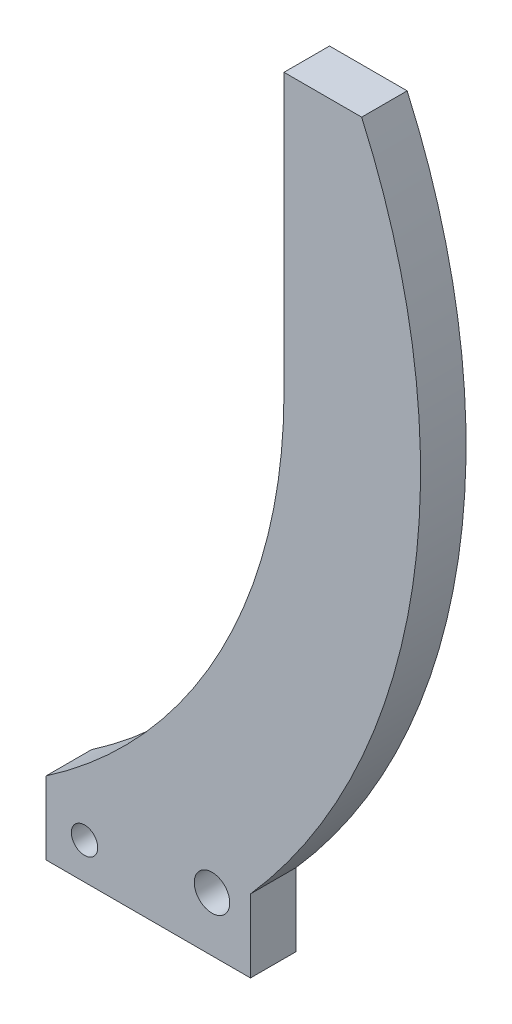
ISO-10303-21;
HEADER;
FILE_DESCRIPTION(('STEP AP214'),'2;1');
FILE_NAME('part.step','',(''),(''),'','','');
FILE_SCHEMA(('AUTOMOTIVE_DESIGN { 1 0 10303 214 1 1 1 1 }'));
ENDSEC;
DATA;
#1=APPLICATION_CONTEXT('core data for automotive mechanical design processes');
#2=APPLICATION_PROTOCOL_DEFINITION('international standard','automotive_design',2000,#1);
#3=PRODUCT_CONTEXT('',#1,'mechanical');
#4=PRODUCT('Part','Part','',(#3));
#5=PRODUCT_RELATED_PRODUCT_CATEGORY('part','',(#4));
#6=PRODUCT_DEFINITION_FORMATION('','',#4);
#7=PRODUCT_DEFINITION_CONTEXT('part definition',#1,'design');
#8=PRODUCT_DEFINITION('design','',#6,#7);
#9=PRODUCT_DEFINITION_SHAPE('','',#8);
#10=(LENGTH_UNIT() NAMED_UNIT(*) SI_UNIT(.MILLI.,.METRE.));
#11=(NAMED_UNIT(*) PLANE_ANGLE_UNIT() SI_UNIT($,.RADIAN.));
#12=(NAMED_UNIT(*) SI_UNIT($,.STERADIAN.) SOLID_ANGLE_UNIT());
#13=UNCERTAINTY_MEASURE_WITH_UNIT(LENGTH_MEASURE(1.E-05),#10,'distance_accuracy_value','');
#14=(GEOMETRIC_REPRESENTATION_CONTEXT(3) GLOBAL_UNCERTAINTY_ASSIGNED_CONTEXT((#13)) GLOBAL_UNIT_ASSIGNED_CONTEXT((#10,
#11,#12)) REPRESENTATION_CONTEXT('',''));
#15=CARTESIAN_POINT('',(0.,0.,0.));
#16=DIRECTION('',(0.,0.,1.));
#17=DIRECTION('',(1.,0.,0.));
#18=AXIS2_PLACEMENT_3D('',#15,#16,#17);
#19=CARTESIAN_POINT('',(0.,0.,5.));
#20=DIRECTION('',(0.,0.,1.));
#21=DIRECTION('',(1.,0.,0.));
#22=AXIS2_PLACEMENT_3D('',#19,#20,#21);
#23=PLANE('',#22);
#24=CARTESIAN_POINT('',(38.0923000629053,-53.529178974409,5.));
#25=DIRECTION('',(0.,0.,1.));
#26=DIRECTION('',(1.,0.,0.));
#27=AXIS2_PLACEMENT_3D('',#24,#25,#26);
#28=CIRCLE('',#27,1.45);
#29=CARTESIAN_POINT('',(39.5423000629053,-53.529178974409,5.));
#30=VERTEX_POINT('',#29);
#31=EDGE_CURVE('E132',#30,#30,#28,.T.);
#32=ORIENTED_EDGE('',*,*,#31,.F.);
#33=EDGE_LOOP('',(#32));
#34=FACE_BOUND('',#33,.T.);
#35=CARTESIAN_POINT('',(0.,0.,5.));
#36=DIRECTION('',(0.,0.,1.));
#37=DIRECTION('',(1.,0.,0.));
#38=AXIS2_PLACEMENT_3D('',#35,#36,#37);
#39=CIRCLE('',#38,75.);
#40=CARTESIAN_POINT('',(56.3192722797531,-49.529178974409,5.));
#41=VERTEX_POINT('',#40);
#42=CARTESIAN_POINT('',(68.5312269409092,30.470821025591,5.));
#43=VERTEX_POINT('',#42);
#44=EDGE_CURVE('E141',#41,#43,#39,.T.);
#45=ORIENTED_EDGE('',*,*,#44,.T.);
#46=DIRECTION('',(-1.,0.,0.));
#47=VECTOR('',#46,1.);
#48=CARTESIAN_POINT('',(60.,30.470821025591,5.));
#49=LINE('',#48,#47);
#50=CARTESIAN_POINT('',(60.,30.470821025591,5.));
#51=VERTEX_POINT('',#50);
#52=EDGE_CURVE('E94',#43,#51,#49,.T.);
#53=ORIENTED_EDGE('',*,*,#52,.T.);
#54=DIRECTION('',(0.,-1.,0.));
#55=VECTOR('',#54,1.);
#56=CARTESIAN_POINT('',(60.,0.,5.));
#57=LINE('',#56,#55);
#58=CARTESIAN_POINT('',(60.,0.,5.));
#59=VERTEX_POINT('',#58);
#60=EDGE_CURVE('E153',#51,#59,#57,.T.);
#61=ORIENTED_EDGE('',*,*,#60,.T.);
#62=CARTESIAN_POINT('',(0.,0.,5.));
#63=DIRECTION('',(0.,0.,-1.));
#64=DIRECTION('',(1.,0.,0.));
#65=AXIS2_PLACEMENT_3D('',#62,#63,#64);
#66=CIRCLE('',#65,60.);
#67=CARTESIAN_POINT('',(33.8653278460575,-49.529178974409,5.));
#68=VERTEX_POINT('',#67);
#69=EDGE_CURVE('E110',#59,#68,#66,.T.);
#70=ORIENTED_EDGE('',*,*,#69,.T.);
#71=DIRECTION('',(0.,-1.,0.));
#72=VECTOR('',#71,1.);
#73=CARTESIAN_POINT('',(33.8653278460575,-49.529178974409,5.));
#74=LINE('',#73,#72);
#75=CARTESIAN_POINT('',(33.8653278460575,-57.529178974409,5.));
#76=VERTEX_POINT('',#75);
#77=EDGE_CURVE('E104',#68,#76,#74,.T.);
#78=ORIENTED_EDGE('',*,*,#77,.T.);
#79=DIRECTION('',(1.,0.,0.));
#80=VECTOR('',#79,1.);
#81=CARTESIAN_POINT('',(56.3192722797531,-57.529178974409,5.));
#82=LINE('',#81,#80);
#83=CARTESIAN_POINT('',(56.3192722797531,-57.529178974409,5.));
#84=VERTEX_POINT('',#83);
#85=EDGE_CURVE('E108',#76,#84,#82,.T.);
#86=ORIENTED_EDGE('',*,*,#85,.T.);
#87=DIRECTION('',(0.,1.,0.));
#88=VECTOR('',#87,1.);
#89=CARTESIAN_POINT('',(56.3192722797531,-49.529178974409,5.));
#90=LINE('',#89,#88);
#91=EDGE_CURVE('E54',#84,#41,#90,.T.);
#92=ORIENTED_EDGE('',*,*,#91,.T.);
#93=EDGE_LOOP('',(#45,#53,#61,#70,#78,#86,#92));
#94=FACE_BOUND('',#93,.T.);
#95=CARTESIAN_POINT('',(52.0923000629053,-51.529178974409,5.));
#96=DIRECTION('',(0.,0.,1.));
#97=DIRECTION('',(1.,0.,0.));
#98=AXIS2_PLACEMENT_3D('',#95,#96,#97);
#99=CIRCLE('',#98,1.94999999999999);
#100=CARTESIAN_POINT('',(54.0423000629053,-51.529178974409,5.));
#101=VERTEX_POINT('',#100);
#102=EDGE_CURVE('E168',#101,#101,#99,.T.);
#103=ORIENTED_EDGE('',*,*,#102,.F.);
#104=EDGE_LOOP('',(#103));
#105=FACE_BOUND('',#104,.T.);
#106=ADVANCED_FACE('F37',(#34,#94,#105),#23,.T.);
#107=CARTESIAN_POINT('',(0.,0.,0.));
#108=DIRECTION('',(0.,0.,1.));
#109=DIRECTION('',(1.,0.,0.));
#110=AXIS2_PLACEMENT_3D('',#107,#108,#109);
#111=PLANE('',#110);
#112=CARTESIAN_POINT('',(0.,0.,0.));
#113=DIRECTION('',(0.,0.,1.));
#114=DIRECTION('',(1.,0.,0.));
#115=AXIS2_PLACEMENT_3D('',#112,#113,#114);
#116=CIRCLE('',#115,75.);
#117=CARTESIAN_POINT('',(56.3192722797531,-49.529178974409,0.));
#118=VERTEX_POINT('',#117);
#119=CARTESIAN_POINT('',(68.5312269409092,30.470821025591,0.));
#120=VERTEX_POINT('',#119);
#121=EDGE_CURVE('E128',#118,#120,#116,.T.);
#122=ORIENTED_EDGE('',*,*,#121,.F.);
#123=DIRECTION('',(0.,1.,0.));
#124=VECTOR('',#123,1.);
#125=CARTESIAN_POINT('',(56.3192722797531,-49.529178974409,0.));
#126=LINE('',#125,#124);
#127=CARTESIAN_POINT('',(56.3192722797531,-57.529178974409,0.));
#128=VERTEX_POINT('',#127);
#129=EDGE_CURVE('E86',#128,#118,#126,.T.);
#130=ORIENTED_EDGE('',*,*,#129,.F.);
#131=DIRECTION('',(1.,0.,0.));
#132=VECTOR('',#131,1.);
#133=CARTESIAN_POINT('',(56.3192722797531,-57.529178974409,0.));
#134=LINE('',#133,#132);
#135=CARTESIAN_POINT('',(33.8653278460575,-57.529178974409,0.));
#136=VERTEX_POINT('',#135);
#137=EDGE_CURVE('E80',#136,#128,#134,.T.);
#138=ORIENTED_EDGE('',*,*,#137,.F.);
#139=DIRECTION('',(0.,-1.,0.));
#140=VECTOR('',#139,1.);
#141=CARTESIAN_POINT('',(33.8653278460575,-49.529178974409,0.));
#142=LINE('',#141,#140);
#143=CARTESIAN_POINT('',(33.8653278460575,-49.529178974409,0.));
#144=VERTEX_POINT('',#143);
#145=EDGE_CURVE('E118',#144,#136,#142,.T.);
#146=ORIENTED_EDGE('',*,*,#145,.F.);
#147=CARTESIAN_POINT('',(0.,0.,0.));
#148=DIRECTION('',(0.,0.,-1.));
#149=DIRECTION('',(1.,0.,0.));
#150=AXIS2_PLACEMENT_3D('',#147,#148,#149);
#151=CIRCLE('',#150,60.);
#152=CARTESIAN_POINT('',(60.,0.,0.));
#153=VERTEX_POINT('',#152);
#154=EDGE_CURVE('E136',#153,#144,#151,.T.);
#155=ORIENTED_EDGE('',*,*,#154,.F.);
#156=DIRECTION('',(0.,-1.,0.));
#157=VECTOR('',#156,1.);
#158=CARTESIAN_POINT('',(60.,0.,0.));
#159=LINE('',#158,#157);
#160=CARTESIAN_POINT('',(60.,30.470821025591,0.));
#161=VERTEX_POINT('',#160);
#162=EDGE_CURVE('E134',#161,#153,#159,.T.);
#163=ORIENTED_EDGE('',*,*,#162,.F.);
#164=DIRECTION('',(-1.,0.,0.));
#165=VECTOR('',#164,1.);
#166=CARTESIAN_POINT('',(60.,30.470821025591,0.));
#167=LINE('',#166,#165);
#168=EDGE_CURVE('E131',#120,#161,#167,.T.);
#169=ORIENTED_EDGE('',*,*,#168,.F.);
#170=EDGE_LOOP('',(#122,#130,#138,#146,#155,#163,#169));
#171=FACE_BOUND('',#170,.T.);
#172=CARTESIAN_POINT('',(38.0923000629053,-53.529178974409,0.));
#173=DIRECTION('',(0.,0.,1.));
#174=DIRECTION('',(1.,0.,0.));
#175=AXIS2_PLACEMENT_3D('',#172,#173,#174);
#176=CIRCLE('',#175,1.45);
#177=CARTESIAN_POINT('',(39.5423000629053,-53.529178974409,0.));
#178=VERTEX_POINT('',#177);
#179=EDGE_CURVE('E165',#178,#178,#176,.T.);
#180=ORIENTED_EDGE('',*,*,#179,.T.);
#181=EDGE_LOOP('',(#180));
#182=FACE_BOUND('',#181,.T.);
#183=CARTESIAN_POINT('',(52.0923000629053,-51.529178974409,0.));
#184=DIRECTION('',(0.,0.,1.));
#185=DIRECTION('',(1.,0.,0.));
#186=AXIS2_PLACEMENT_3D('',#183,#184,#185);
#187=CIRCLE('',#186,1.94999999999999);
#188=CARTESIAN_POINT('',(54.0423000629053,-51.529178974409,0.));
#189=VERTEX_POINT('',#188);
#190=EDGE_CURVE('E171',#189,#189,#187,.T.);
#191=ORIENTED_EDGE('',*,*,#190,.T.);
#192=EDGE_LOOP('',(#191));
#193=FACE_BOUND('',#192,.T.);
#194=ADVANCED_FACE('F157',(#171,#182,#193),#111,.F.);
#195=CARTESIAN_POINT('',(0.,0.,5.));
#196=DIRECTION('',(0.,0.,-1.));
#197=DIRECTION('',(-1.,0.,0.));
#198=AXIS2_PLACEMENT_3D('',#195,#196,#197);
#199=CYLINDRICAL_SURFACE('',#198,75.);
#200=ORIENTED_EDGE('',*,*,#121,.T.);
#201=DIRECTION('',(0.,0.,-1.));
#202=VECTOR('',#201,1.);
#203=CARTESIAN_POINT('',(68.5312269409092,30.470821025591,5.));
#204=LINE('',#203,#202);
#205=EDGE_CURVE('E11',#43,#120,#204,.T.);
#206=ORIENTED_EDGE('',*,*,#205,.F.);
#207=ORIENTED_EDGE('',*,*,#44,.F.);
#208=DIRECTION('',(0.,0.,-1.));
#209=VECTOR('',#208,1.);
#210=CARTESIAN_POINT('',(56.3192722797531,-49.529178974409,5.));
#211=LINE('',#210,#209);
#212=EDGE_CURVE('E124',#41,#118,#211,.T.);
#213=ORIENTED_EDGE('',*,*,#212,.T.);
#214=EDGE_LOOP('',(#200,#206,#207,#213));
#215=FACE_BOUND('',#214,.T.);
#216=ADVANCED_FACE('F39',(#215),#199,.T.);
#217=CARTESIAN_POINT('',(60.,30.470821025591,5.));
#218=DIRECTION('',(0.,-1.,0.));
#219=DIRECTION('',(1.,0.,0.));
#220=AXIS2_PLACEMENT_3D('',#217,#218,#219);
#221=PLANE('',#220);
#222=ORIENTED_EDGE('',*,*,#168,.T.);
#223=DIRECTION('',(0.,0.,-1.));
#224=VECTOR('',#223,1.);
#225=CARTESIAN_POINT('',(60.,30.470821025591,5.));
#226=LINE('',#225,#224);
#227=EDGE_CURVE('E46',#51,#161,#226,.T.);
#228=ORIENTED_EDGE('',*,*,#227,.F.);
#229=ORIENTED_EDGE('',*,*,#52,.F.);
#230=ORIENTED_EDGE('',*,*,#205,.T.);
#231=EDGE_LOOP('',(#222,#228,#229,#230));
#232=FACE_BOUND('',#231,.T.);
#233=ADVANCED_FACE('F201',(#232),#221,.F.);
#234=CARTESIAN_POINT('',(60.,0.,5.));
#235=DIRECTION('',(1.,0.,0.));
#236=DIRECTION('',(0.,1.,0.));
#237=AXIS2_PLACEMENT_3D('',#234,#235,#236);
#238=PLANE('',#237);
#239=ORIENTED_EDGE('',*,*,#162,.T.);
#240=DIRECTION('',(0.,0.,-1.));
#241=VECTOR('',#240,1.);
#242=CARTESIAN_POINT('',(60.,0.,5.));
#243=LINE('',#242,#241);
#244=EDGE_CURVE('E145',#59,#153,#243,.T.);
#245=ORIENTED_EDGE('',*,*,#244,.F.);
#246=ORIENTED_EDGE('',*,*,#60,.F.);
#247=ORIENTED_EDGE('',*,*,#227,.T.);
#248=EDGE_LOOP('',(#239,#245,#246,#247));
#249=FACE_BOUND('',#248,.T.);
#250=ADVANCED_FACE('F151',(#249),#238,.F.);
#251=CARTESIAN_POINT('',(0.,0.,5.));
#252=DIRECTION('',(0.,0.,-1.));
#253=DIRECTION('',(-1.,0.,0.));
#254=AXIS2_PLACEMENT_3D('',#251,#252,#253);
#255=CYLINDRICAL_SURFACE('',#254,60.);
#256=ORIENTED_EDGE('',*,*,#154,.T.);
#257=DIRECTION('',(0.,0.,-1.));
#258=VECTOR('',#257,1.);
#259=CARTESIAN_POINT('',(33.8653278460575,-49.529178974409,5.));
#260=LINE('',#259,#258);
#261=EDGE_CURVE('E119',#68,#144,#260,.T.);
#262=ORIENTED_EDGE('',*,*,#261,.F.);
#263=ORIENTED_EDGE('',*,*,#69,.F.);
#264=ORIENTED_EDGE('',*,*,#244,.T.);
#265=EDGE_LOOP('',(#256,#262,#263,#264));
#266=FACE_BOUND('',#265,.T.);
#267=ADVANCED_FACE('F160',(#266),#255,.F.);
#268=CARTESIAN_POINT('',(33.8653278460575,-49.529178974409,5.));
#269=DIRECTION('',(1.,0.,0.));
#270=DIRECTION('',(0.,0.,-1.));
#271=AXIS2_PLACEMENT_3D('',#268,#269,#270);
#272=PLANE('',#271);
#273=ORIENTED_EDGE('',*,*,#145,.T.);
#274=DIRECTION('',(0.,0.,-1.));
#275=VECTOR('',#274,1.);
#276=CARTESIAN_POINT('',(33.8653278460575,-57.529178974409,5.));
#277=LINE('',#276,#275);
#278=EDGE_CURVE('E115',#76,#136,#277,.T.);
#279=ORIENTED_EDGE('',*,*,#278,.F.);
#280=ORIENTED_EDGE('',*,*,#77,.F.);
#281=ORIENTED_EDGE('',*,*,#261,.T.);
#282=EDGE_LOOP('',(#273,#279,#280,#281));
#283=FACE_BOUND('',#282,.T.);
#284=ADVANCED_FACE('F116',(#283),#272,.F.);
#285=CARTESIAN_POINT('',(56.3192722797531,-57.529178974409,5.));
#286=DIRECTION('',(0.,1.,0.));
#287=DIRECTION('',(0.,0.,1.));
#288=AXIS2_PLACEMENT_3D('',#285,#286,#287);
#289=PLANE('',#288);
#290=ORIENTED_EDGE('',*,*,#137,.T.);
#291=DIRECTION('',(0.,0.,-1.));
#292=VECTOR('',#291,1.);
#293=CARTESIAN_POINT('',(56.3192722797531,-57.529178974409,5.));
#294=LINE('',#293,#292);
#295=EDGE_CURVE('E120',#84,#128,#294,.T.);
#296=ORIENTED_EDGE('',*,*,#295,.F.);
#297=ORIENTED_EDGE('',*,*,#85,.F.);
#298=ORIENTED_EDGE('',*,*,#278,.T.);
#299=EDGE_LOOP('',(#290,#296,#297,#298));
#300=FACE_BOUND('',#299,.T.);
#301=ADVANCED_FACE('F122',(#300),#289,.F.);
#302=CARTESIAN_POINT('',(56.3192722797531,-49.529178974409,5.));
#303=DIRECTION('',(-1.,0.,0.));
#304=DIRECTION('',(0.,0.,1.));
#305=AXIS2_PLACEMENT_3D('',#302,#303,#304);
#306=PLANE('',#305);
#307=ORIENTED_EDGE('',*,*,#129,.T.);
#308=ORIENTED_EDGE('',*,*,#212,.F.);
#309=ORIENTED_EDGE('',*,*,#91,.F.);
#310=ORIENTED_EDGE('',*,*,#295,.T.);
#311=EDGE_LOOP('',(#307,#308,#309,#310));
#312=FACE_BOUND('',#311,.T.);
#313=ADVANCED_FACE('F191',(#312),#306,.F.);
#314=CARTESIAN_POINT('',(38.0923000629053,-53.529178974409,5.));
#315=DIRECTION('',(0.,0.,-1.));
#316=DIRECTION('',(-1.,0.,0.));
#317=AXIS2_PLACEMENT_3D('',#314,#315,#316);
#318=CYLINDRICAL_SURFACE('',#317,1.45);
#319=ORIENTED_EDGE('',*,*,#31,.T.);
#320=EDGE_LOOP('',(#319));
#321=FACE_BOUND('',#320,.T.);
#322=ORIENTED_EDGE('',*,*,#179,.F.);
#323=EDGE_LOOP('',(#322));
#324=FACE_BOUND('',#323,.T.);
#325=ADVANCED_FACE('F188',(#321,#324),#318,.F.);
#326=CARTESIAN_POINT('',(52.0923000629053,-51.529178974409,5.));
#327=DIRECTION('',(0.,0.,-1.));
#328=DIRECTION('',(-1.,0.,0.));
#329=AXIS2_PLACEMENT_3D('',#326,#327,#328);
#330=CYLINDRICAL_SURFACE('',#329,1.94999999999999);
#331=ORIENTED_EDGE('',*,*,#102,.T.);
#332=EDGE_LOOP('',(#331));
#333=FACE_BOUND('',#332,.T.);
#334=ORIENTED_EDGE('',*,*,#190,.F.);
#335=EDGE_LOOP('',(#334));
#336=FACE_BOUND('',#335,.T.);
#337=ADVANCED_FACE('F177',(#333,#336),#330,.F.);
#338=CLOSED_SHELL('',(#106,#194,#216,#233,#250,#267,#284,#301,#313,#325,#337));
#339=MANIFOLD_SOLID_BREP('B2',#338);
#340=ADVANCED_BREP_SHAPE_REPRESENTATION('',(#18,#339),#14);
#341=SHAPE_DEFINITION_REPRESENTATION(#9,#340);
ENDSEC;
END-ISO-10303-21;
